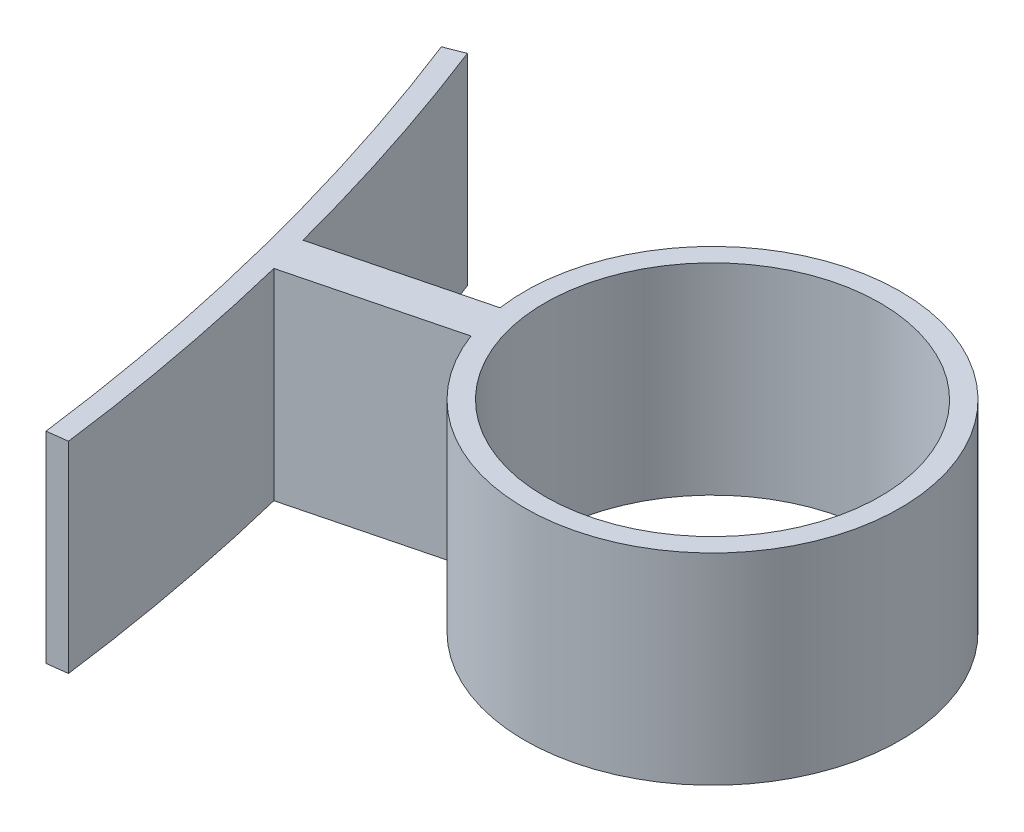
ISO-10303-21;
HEADER;
FILE_DESCRIPTION(('STEP AP214'),'2;1');
FILE_NAME('part.step','',(''),(''),'','','');
FILE_SCHEMA(('AUTOMOTIVE_DESIGN { 1 0 10303 214 1 1 1 1 }'));
ENDSEC;
DATA;
#1=APPLICATION_CONTEXT('core data for automotive mechanical design processes');
#2=APPLICATION_PROTOCOL_DEFINITION('international standard','automotive_design',2000,#1);
#3=PRODUCT_CONTEXT('',#1,'mechanical');
#4=PRODUCT('Part','Part','',(#3));
#5=PRODUCT_RELATED_PRODUCT_CATEGORY('part','',(#4));
#6=PRODUCT_DEFINITION_FORMATION('','',#4);
#7=PRODUCT_DEFINITION_CONTEXT('part definition',#1,'design');
#8=PRODUCT_DEFINITION('design','',#6,#7);
#9=PRODUCT_DEFINITION_SHAPE('','',#8);
#10=(LENGTH_UNIT() NAMED_UNIT(*) SI_UNIT(.MILLI.,.METRE.));
#11=(NAMED_UNIT(*) PLANE_ANGLE_UNIT() SI_UNIT($,.RADIAN.));
#12=(NAMED_UNIT(*) SI_UNIT($,.STERADIAN.) SOLID_ANGLE_UNIT());
#13=UNCERTAINTY_MEASURE_WITH_UNIT(LENGTH_MEASURE(1.E-05),#10,'distance_accuracy_value','');
#14=(GEOMETRIC_REPRESENTATION_CONTEXT(3) GLOBAL_UNCERTAINTY_ASSIGNED_CONTEXT((#13)) GLOBAL_UNIT_ASSIGNED_CONTEXT((#10,
#11,#12)) REPRESENTATION_CONTEXT('',''));
#15=CARTESIAN_POINT('',(0.,0.,0.));
#16=DIRECTION('',(0.,0.,1.));
#17=DIRECTION('',(1.,0.,0.));
#18=AXIS2_PLACEMENT_3D('',#15,#16,#17);
#19=CARTESIAN_POINT('',(-377.924478984537,30.,96.2968752570216));
#20=DIRECTION('',(0.,-1.,0.));
#21=DIRECTION('',(0.,0.,-1.));
#22=AXIS2_PLACEMENT_3D('',#19,#20,#21);
#23=CYLINDRICAL_SURFACE('',#22,338.);
#24=CARTESIAN_POINT('',(-377.924478984537,0.,96.2968752570216));
#25=DIRECTION('',(0.,1.,0.));
#26=DIRECTION('',(0.,0.,1.));
#27=AXIS2_PLACEMENT_3D('',#24,#25,#26);
#28=CIRCLE('',#27,338.);
#29=CARTESIAN_POINT('',(-49.6620869729352,0.,15.7499821398964));
#30=VERTEX_POINT('',#29);
#31=CARTESIAN_POINT('',(-42.6604380227351,0.,53.3780817282735));
#32=VERTEX_POINT('',#31);
#33=EDGE_CURVE('E138',#30,#32,#28,.F.);
#34=ORIENTED_EDGE('',*,*,#33,.F.);
#35=DIRECTION('',(0.,-1.,0.));
#36=VECTOR('',#35,1.);
#37=CARTESIAN_POINT('',(-49.6620869729352,30.,15.7499821398964));
#38=LINE('',#37,#36);
#39=CARTESIAN_POINT('',(-49.6620869729352,30.,15.7499821398964));
#40=VERTEX_POINT('',#39);
#41=EDGE_CURVE('E11',#40,#30,#38,.T.);
#42=ORIENTED_EDGE('',*,*,#41,.F.);
#43=CARTESIAN_POINT('',(-377.924478984537,30.,96.2968752570216));
#44=DIRECTION('',(0.,1.,0.));
#45=DIRECTION('',(0.,0.,1.));
#46=AXIS2_PLACEMENT_3D('',#43,#44,#45);
#47=CIRCLE('',#46,338.);
#48=CARTESIAN_POINT('',(-42.6604380227351,30.,53.3780817282735));
#49=VERTEX_POINT('',#48);
#50=EDGE_CURVE('E208',#40,#49,#47,.F.);
#51=ORIENTED_EDGE('',*,*,#50,.T.);
#52=DIRECTION('',(0.,-1.,0.));
#53=VECTOR('',#52,1.);
#54=CARTESIAN_POINT('',(-42.6604380227351,30.,53.3780817282735));
#55=LINE('',#54,#53);
#56=EDGE_CURVE('E88',#49,#32,#55,.T.);
#57=ORIENTED_EDGE('',*,*,#56,.T.);
#58=EDGE_LOOP('',(#34,#42,#51,#57));
#59=FACE_BOUND('',#58,.T.);
#60=ADVANCED_FACE('F36',(#59),#23,.T.);
#61=CARTESIAN_POINT('',(0.740745194284781,30.,2.90711137680413));
#62=DIRECTION('',(-0.246915064761594,0.,-0.969037125601376));
#63=DIRECTION('',(-0.969037125601376,0.,0.246915064761594));
#64=AXIS2_PLACEMENT_3D('',#61,#62,#63);
#65=PLANE('',#64);
#66=DIRECTION('',(0.969037125601377,0.,-0.246915064761594));
#67=VECTOR('',#66,1.);
#68=CARTESIAN_POINT('',(0.740745194284781,0.,2.90711137680413));
#69=LINE('',#68,#67);
#70=CARTESIAN_POINT('',(-26.2361066766281,0.,9.78093586793148));
#71=VERTEX_POINT('',#70);
#72=EDGE_CURVE('E140',#30,#71,#69,.T.);
#73=ORIENTED_EDGE('',*,*,#72,.T.);
#74=DIRECTION('',(0.,-1.,0.));
#75=VECTOR('',#74,1.);
#76=CARTESIAN_POINT('',(-26.2361066766281,30.,9.78093586793148));
#77=LINE('',#76,#75);
#78=CARTESIAN_POINT('',(-26.2361066766281,30.,9.78093586793148));
#79=VERTEX_POINT('',#78);
#80=EDGE_CURVE('E45',#79,#71,#77,.T.);
#81=ORIENTED_EDGE('',*,*,#80,.F.);
#82=DIRECTION('',(0.969037125601377,0.,-0.246915064761594));
#83=VECTOR('',#82,1.);
#84=CARTESIAN_POINT('',(0.740745194284781,30.,2.90711137680413));
#85=LINE('',#84,#83);
#86=EDGE_CURVE('E210',#40,#79,#85,.T.);
#87=ORIENTED_EDGE('',*,*,#86,.F.);
#88=ORIENTED_EDGE('',*,*,#41,.T.);
#89=EDGE_LOOP('',(#73,#81,#87,#88));
#90=FACE_BOUND('',#89,.T.);
#91=ADVANCED_FACE('F172',(#90),#65,.F.);
#92=CARTESIAN_POINT('',(0.,30.,0.));
#93=DIRECTION('',(0.,-1.,0.));
#94=DIRECTION('',(0.,0.,-1.));
#95=AXIS2_PLACEMENT_3D('',#92,#93,#94);
#96=CYLINDRICAL_SURFACE('',#95,28.);
#97=CARTESIAN_POINT('',(0.,0.,0.));
#98=DIRECTION('',(0.,1.,0.));
#99=DIRECTION('',(0.,0.,1.));
#100=AXIS2_PLACEMENT_3D('',#97,#98,#99);
#101=CIRCLE('',#100,28.);
#102=CARTESIAN_POINT('',(-27.7175970651977,0.,3.96671311432322));
#103=VERTEX_POINT('',#102);
#104=EDGE_CURVE('E143',#71,#103,#101,.T.);
#105=ORIENTED_EDGE('',*,*,#104,.T.);
#106=DIRECTION('',(0.,-1.,0.));
#107=VECTOR('',#106,1.);
#108=CARTESIAN_POINT('',(-27.7175970651977,30.,3.96671311432322));
#109=LINE('',#108,#107);
#110=CARTESIAN_POINT('',(-27.7175970651977,30.,3.96671311432322));
#111=VERTEX_POINT('',#110);
#112=EDGE_CURVE('E162',#111,#103,#109,.T.);
#113=ORIENTED_EDGE('',*,*,#112,.F.);
#114=CARTESIAN_POINT('',(0.,30.,0.));
#115=DIRECTION('',(0.,1.,0.));
#116=DIRECTION('',(0.,0.,1.));
#117=AXIS2_PLACEMENT_3D('',#114,#115,#116);
#118=CIRCLE('',#117,28.);
#119=EDGE_CURVE('E168',#79,#111,#118,.T.);
#120=ORIENTED_EDGE('',*,*,#119,.F.);
#121=ORIENTED_EDGE('',*,*,#80,.T.);
#122=EDGE_LOOP('',(#105,#113,#120,#121));
#123=FACE_BOUND('',#122,.T.);
#124=ADVANCED_FACE('F166',(#123),#96,.T.);
#125=CARTESIAN_POINT('',(-0.740745194284787,30.,-2.90711137680414));
#126=DIRECTION('',(-0.246915064761594,0.,-0.969037125601376));
#127=DIRECTION('',(-0.969037125601376,0.,0.246915064761594));
#128=AXIS2_PLACEMENT_3D('',#125,#126,#127);
#129=PLANE('',#128);
#130=DIRECTION('',(0.969037125601377,0.,-0.246915064761594));
#131=VECTOR('',#130,1.);
#132=CARTESIAN_POINT('',(-0.740745194284787,0.,-2.90711137680414));
#133=LINE('',#132,#131);
#134=CARTESIAN_POINT('',(-51.1435773615048,0.,9.93575938628813));
#135=VERTEX_POINT('',#134);
#136=EDGE_CURVE('E146',#135,#103,#133,.T.);
#137=ORIENTED_EDGE('',*,*,#136,.F.);
#138=DIRECTION('',(0.,-1.,0.));
#139=VECTOR('',#138,1.);
#140=CARTESIAN_POINT('',(-51.1435773615048,30.,9.93575938628813));
#141=LINE('',#140,#139);
#142=CARTESIAN_POINT('',(-51.1435773615048,30.,9.93575938628813));
#143=VERTEX_POINT('',#142);
#144=EDGE_CURVE('E160',#143,#135,#141,.T.);
#145=ORIENTED_EDGE('',*,*,#144,.F.);
#146=DIRECTION('',(0.969037125601377,0.,-0.246915064761594));
#147=VECTOR('',#146,1.);
#148=CARTESIAN_POINT('',(-0.740745194284787,30.,-2.90711137680414));
#149=LINE('',#148,#147);
#150=EDGE_CURVE('E130',#143,#111,#149,.T.);
#151=ORIENTED_EDGE('',*,*,#150,.T.);
#152=ORIENTED_EDGE('',*,*,#112,.T.);
#153=EDGE_LOOP('',(#137,#145,#151,#152));
#154=FACE_BOUND('',#153,.T.);
#155=ADVANCED_FACE('F182',(#154),#129,.T.);
#156=CARTESIAN_POINT('',(-377.924478984537,30.,96.2968752570216));
#157=DIRECTION('',(0.,-1.,0.));
#158=DIRECTION('',(0.,0.,-1.));
#159=AXIS2_PLACEMENT_3D('',#156,#157,#158);
#160=CYLINDRICAL_SURFACE('',#159,338.);
#161=CARTESIAN_POINT('',(-377.924478984537,0.,96.2968752570216));
#162=DIRECTION('',(0.,1.,0.));
#163=DIRECTION('',(0.,0.,1.));
#164=AXIS2_PLACEMENT_3D('',#161,#162,#163);
#165=CIRCLE('',#164,338.);
#166=CARTESIAN_POINT('',(-63.0022087526056,0.,-26.4547589967286));
#167=VERTEX_POINT('',#166);
#168=EDGE_CURVE('E149',#167,#135,#165,.F.);
#169=ORIENTED_EDGE('',*,*,#168,.F.);
#170=DIRECTION('',(0.,-1.,0.));
#171=VECTOR('',#170,1.);
#172=CARTESIAN_POINT('',(-63.0022087526056,30.,-26.4547589967286));
#173=LINE('',#172,#171);
#174=CARTESIAN_POINT('',(-63.0022087526056,30.,-26.4547589967286));
#175=VERTEX_POINT('',#174);
#176=EDGE_CURVE('E117',#175,#167,#173,.T.);
#177=ORIENTED_EDGE('',*,*,#176,.F.);
#178=CARTESIAN_POINT('',(-377.924478984537,30.,96.2968752570216));
#179=DIRECTION('',(0.,1.,0.));
#180=DIRECTION('',(0.,0.,1.));
#181=AXIS2_PLACEMENT_3D('',#178,#179,#180);
#182=CIRCLE('',#181,338.);
#183=EDGE_CURVE('E128',#175,#143,#182,.F.);
#184=ORIENTED_EDGE('',*,*,#183,.T.);
#185=ORIENTED_EDGE('',*,*,#144,.T.);
#186=EDGE_LOOP('',(#169,#177,#184,#185));
#187=FACE_BOUND('',#186,.T.);
#188=ADVANCED_FACE('F185',(#187),#160,.T.);
#189=CARTESIAN_POINT('',(-17.2611473866313,30.,-44.283888804028));
#190=DIRECTION('',(-0.363170515543646,0.,-0.931722692993877));
#191=DIRECTION('',(-0.931722692993877,0.,0.363170515543646));
#192=AXIS2_PLACEMENT_3D('',#189,#190,#191);
#193=PLANE('',#192);
#194=DIRECTION('',(0.931722692993877,0.,-0.363170515543646));
#195=VECTOR('',#194,1.);
#196=CARTESIAN_POINT('',(-17.2611473866313,0.,-44.283888804028));
#197=LINE('',#196,#195);
#198=CARTESIAN_POINT('',(-65.7973768315871,0.,-25.3652474500977));
#199=VERTEX_POINT('',#198);
#200=EDGE_CURVE('E114',#199,#167,#197,.T.);
#201=ORIENTED_EDGE('',*,*,#200,.F.);
#202=DIRECTION('',(0.,-1.,0.));
#203=VECTOR('',#202,1.);
#204=CARTESIAN_POINT('',(-65.7973768315871,30.,-25.3652474500977));
#205=LINE('',#204,#203);
#206=CARTESIAN_POINT('',(-65.7973768315871,30.,-25.3652474500977));
#207=VERTEX_POINT('',#206);
#208=EDGE_CURVE('E108',#207,#199,#205,.T.);
#209=ORIENTED_EDGE('',*,*,#208,.F.);
#210=DIRECTION('',(0.931722692993877,0.,-0.363170515543646));
#211=VECTOR('',#210,1.);
#212=CARTESIAN_POINT('',(-17.2611473866313,30.,-44.283888804028));
#213=LINE('',#212,#211);
#214=EDGE_CURVE('E112',#207,#175,#213,.T.);
#215=ORIENTED_EDGE('',*,*,#214,.T.);
#216=ORIENTED_EDGE('',*,*,#176,.T.);
#217=EDGE_LOOP('',(#201,#209,#215,#216));
#218=FACE_BOUND('',#217,.T.);
#219=ADVANCED_FACE('F110',(#218),#193,.T.);
#220=CARTESIAN_POINT('',(-377.924478984537,30.,96.2968752570216));
#221=DIRECTION('',(0.,-1.,0.));
#222=DIRECTION('',(0.,0.,-1.));
#223=AXIS2_PLACEMENT_3D('',#220,#221,#222);
#224=CYLINDRICAL_SURFACE('',#223,335.);
#225=CARTESIAN_POINT('',(-377.924478984537,0.,96.2968752570216));
#226=DIRECTION('',(0.,1.,0.));
#227=DIRECTION('',(0.,0.,1.));
#228=AXIS2_PLACEMENT_3D('',#225,#226,#227);
#229=CIRCLE('',#228,335.);
#230=CARTESIAN_POINT('',(-45.6361543626328,0.,53.7590177655109));
#231=VERTEX_POINT('',#230);
#232=EDGE_CURVE('E153',#199,#231,#229,.F.);
#233=ORIENTED_EDGE('',*,*,#232,.T.);
#234=DIRECTION('',(0.,-1.,0.));
#235=VECTOR('',#234,1.);
#236=CARTESIAN_POINT('',(-45.6361543626328,30.,53.7590177655109));
#237=LINE('',#236,#235);
#238=CARTESIAN_POINT('',(-45.6361543626328,30.,53.7590177655109));
#239=VERTEX_POINT('',#238);
#240=EDGE_CURVE('E118',#239,#231,#237,.T.);
#241=ORIENTED_EDGE('',*,*,#240,.F.);
#242=CARTESIAN_POINT('',(-377.924478984537,30.,96.2968752570216));
#243=DIRECTION('',(0.,1.,0.));
#244=DIRECTION('',(0.,0.,1.));
#245=AXIS2_PLACEMENT_3D('',#242,#243,#244);
#246=CIRCLE('',#245,335.);
#247=EDGE_CURVE('E121',#207,#239,#246,.F.);
#248=ORIENTED_EDGE('',*,*,#247,.F.);
#249=ORIENTED_EDGE('',*,*,#208,.T.);
#250=EDGE_LOOP('',(#233,#241,#248,#249));
#251=FACE_BOUND('',#250,.T.);
#252=ADVANCED_FACE('F122',(#251),#224,.F.);
#253=CARTESIAN_POINT('',(0.,30.,0.));
#254=DIRECTION('',(0.,-1.,0.));
#255=DIRECTION('',(0.,0.,-1.));
#256=AXIS2_PLACEMENT_3D('',#253,#254,#255);
#257=CYLINDRICAL_SURFACE('',#256,25.);
#258=CARTESIAN_POINT('',(0.,30.,0.));
#259=DIRECTION('',(0.,1.,0.));
#260=DIRECTION('',(0.,0.,1.));
#261=AXIS2_PLACEMENT_3D('',#258,#259,#260);
#262=CIRCLE('',#261,25.);
#263=CARTESIAN_POINT('',(0.,30.,25.));
#264=VERTEX_POINT('',#263);
#265=EDGE_CURVE('E156',#264,#264,#262,.T.);
#266=ORIENTED_EDGE('',*,*,#265,.T.);
#267=EDGE_LOOP('',(#266));
#268=FACE_BOUND('',#267,.T.);
#269=CARTESIAN_POINT('',(0.,0.,0.));
#270=DIRECTION('',(0.,1.,0.));
#271=DIRECTION('',(0.,0.,1.));
#272=AXIS2_PLACEMENT_3D('',#269,#270,#271);
#273=CIRCLE('',#272,25.);
#274=CARTESIAN_POINT('',(0.,0.,25.));
#275=VERTEX_POINT('',#274);
#276=EDGE_CURVE('E135',#275,#275,#273,.T.);
#277=ORIENTED_EDGE('',*,*,#276,.F.);
#278=EDGE_LOOP('',(#277));
#279=FACE_BOUND('',#278,.T.);
#280=ADVANCED_FACE('F38',(#268,#279),#257,.F.);
#281=CARTESIAN_POINT('',(6.03517521587273,30.,47.1443175454283));
#282=DIRECTION('',(-0.126978679079138,0.,-0.991905446632549));
#283=DIRECTION('',(-0.99190544663255,0.,0.126978679079138));
#284=AXIS2_PLACEMENT_3D('',#281,#282,#283);
#285=PLANE('',#284);
#286=DIRECTION('',(0.99190544663255,0.,-0.126978679079138));
#287=VECTOR('',#286,1.);
#288=CARTESIAN_POINT('',(6.03517521587273,0.,47.1443175454283));
#289=LINE('',#288,#287);
#290=EDGE_CURVE('E81',#231,#32,#289,.T.);
#291=ORIENTED_EDGE('',*,*,#290,.T.);
#292=ORIENTED_EDGE('',*,*,#56,.F.);
#293=DIRECTION('',(0.99190544663255,0.,-0.126978679079138));
#294=VECTOR('',#293,1.);
#295=CARTESIAN_POINT('',(6.03517521587273,30.,47.1443175454283));
#296=LINE('',#295,#294);
#297=EDGE_CURVE('E53',#239,#49,#296,.T.);
#298=ORIENTED_EDGE('',*,*,#297,.F.);
#299=ORIENTED_EDGE('',*,*,#240,.T.);
#300=EDGE_LOOP('',(#291,#292,#298,#299));
#301=FACE_BOUND('',#300,.T.);
#302=ADVANCED_FACE('F194',(#301),#285,.F.);
#303=CARTESIAN_POINT('',(0.,30.,0.));
#304=DIRECTION('',(0.,1.,0.));
#305=DIRECTION('',(0.,0.,1.));
#306=AXIS2_PLACEMENT_3D('',#303,#304,#305);
#307=PLANE('',#306);
#308=ORIENTED_EDGE('',*,*,#265,.F.);
#309=EDGE_LOOP('',(#308));
#310=FACE_BOUND('',#309,.T.);
#311=ORIENTED_EDGE('',*,*,#50,.F.);
#312=ORIENTED_EDGE('',*,*,#86,.T.);
#313=ORIENTED_EDGE('',*,*,#119,.T.);
#314=ORIENTED_EDGE('',*,*,#150,.F.);
#315=ORIENTED_EDGE('',*,*,#183,.F.);
#316=ORIENTED_EDGE('',*,*,#214,.F.);
#317=ORIENTED_EDGE('',*,*,#247,.T.);
#318=ORIENTED_EDGE('',*,*,#297,.T.);
#319=EDGE_LOOP('',(#311,#312,#313,#314,#315,#316,#317,#318));
#320=FACE_BOUND('',#319,.T.);
#321=ADVANCED_FACE('F125',(#310,#320),#307,.T.);
#322=CARTESIAN_POINT('',(0.,0.,0.));
#323=DIRECTION('',(0.,1.,0.));
#324=DIRECTION('',(0.,0.,1.));
#325=AXIS2_PLACEMENT_3D('',#322,#323,#324);
#326=PLANE('',#325);
#327=ORIENTED_EDGE('',*,*,#276,.T.);
#328=EDGE_LOOP('',(#327));
#329=FACE_BOUND('',#328,.T.);
#330=ORIENTED_EDGE('',*,*,#33,.T.);
#331=ORIENTED_EDGE('',*,*,#290,.F.);
#332=ORIENTED_EDGE('',*,*,#232,.F.);
#333=ORIENTED_EDGE('',*,*,#200,.T.);
#334=ORIENTED_EDGE('',*,*,#168,.T.);
#335=ORIENTED_EDGE('',*,*,#136,.T.);
#336=ORIENTED_EDGE('',*,*,#104,.F.);
#337=ORIENTED_EDGE('',*,*,#72,.F.);
#338=EDGE_LOOP('',(#330,#331,#332,#333,#334,#335,#336,#337));
#339=FACE_BOUND('',#338,.T.);
#340=ADVANCED_FACE('F173',(#329,#339),#326,.F.);
#341=CLOSED_SHELL('',(#60,#91,#124,#155,#188,#219,#252,#280,#302,#321,#340));
#342=MANIFOLD_SOLID_BREP('B2',#341);
#343=ADVANCED_BREP_SHAPE_REPRESENTATION('',(#18,#342),#14);
#344=SHAPE_DEFINITION_REPRESENTATION(#9,#343);
ENDSEC;
END-ISO-10303-21;
